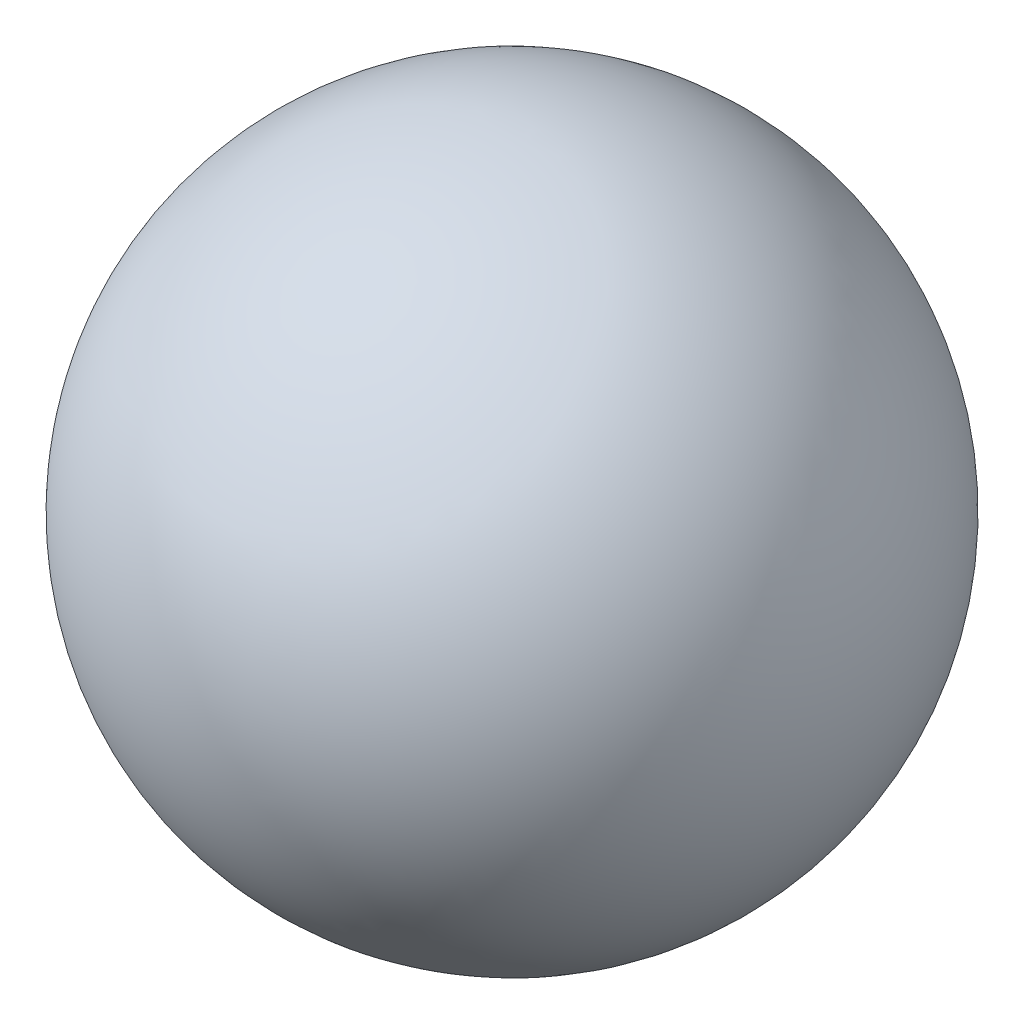
ISO-10303-21;
HEADER;
FILE_DESCRIPTION(('STEP AP214'),'2;1');
FILE_NAME('part.step','',(''),(''),'','','');
FILE_SCHEMA(('AUTOMOTIVE_DESIGN { 1 0 10303 214 1 1 1 1 }'));
ENDSEC;
DATA;
#1=APPLICATION_CONTEXT('core data for automotive mechanical design processes');
#2=APPLICATION_PROTOCOL_DEFINITION('international standard','automotive_design',2000,#1);
#3=PRODUCT_CONTEXT('',#1,'mechanical');
#4=PRODUCT('Part','Part','',(#3));
#5=PRODUCT_RELATED_PRODUCT_CATEGORY('part','',(#4));
#6=PRODUCT_DEFINITION_FORMATION('','',#4);
#7=PRODUCT_DEFINITION_CONTEXT('part definition',#1,'design');
#8=PRODUCT_DEFINITION('design','',#6,#7);
#9=PRODUCT_DEFINITION_SHAPE('','',#8);
#10=(LENGTH_UNIT() NAMED_UNIT(*) SI_UNIT(.MILLI.,.METRE.));
#11=(NAMED_UNIT(*) PLANE_ANGLE_UNIT() SI_UNIT($,.RADIAN.));
#12=(NAMED_UNIT(*) SI_UNIT($,.STERADIAN.) SOLID_ANGLE_UNIT());
#13=UNCERTAINTY_MEASURE_WITH_UNIT(LENGTH_MEASURE(1.E-05),#10,'distance_accuracy_value','');
#14=(GEOMETRIC_REPRESENTATION_CONTEXT(3) GLOBAL_UNCERTAINTY_ASSIGNED_CONTEXT((#13)) GLOBAL_UNIT_ASSIGNED_CONTEXT((#10,
#11,#12)) REPRESENTATION_CONTEXT('',''));
#15=CARTESIAN_POINT('',(0.,0.,0.));
#16=DIRECTION('',(0.,0.,1.));
#17=DIRECTION('',(1.,0.,0.));
#18=AXIS2_PLACEMENT_3D('',#15,#16,#17);
#19=CARTESIAN_POINT('',(49.75,51.9830900727355,-10.3298280111465));
#20=DIRECTION('',(0.,0.980822273280607,-0.194904254024027));
#21=DIRECTION('',(0.173648177666934,0.191943220457923,0.9659213790538));
#22=AXIS2_PLACEMENT_3D('',#19,#20,#21);
#23=SPHERICAL_SURFACE('',#22,5.95);
#24=CARTESIAN_POINT('',(49.75,46.1471975467159,-9.17014769970354));
#25=VERTEX_POINT('',#24);
#26=VERTEX_LOOP('',#25);
#27=FACE_BOUND('',#26,.T.);
#28=CARTESIAN_POINT('',(49.75,57.8189825987551,-11.4895083225895));
#29=VERTEX_POINT('',#28);
#30=VERTEX_LOOP('',#29);
#31=FACE_BOUND('',#30,.T.);
#32=ADVANCED_FACE('F16',(#27,#31),#23,.T.);
#33=CLOSED_SHELL('',(#32));
#34=MANIFOLD_SOLID_BREP('B1',#33);
#35=ADVANCED_BREP_SHAPE_REPRESENTATION('',(#18,#34),#14);
#36=SHAPE_DEFINITION_REPRESENTATION(#9,#35);
ENDSEC;
END-ISO-10303-21;
